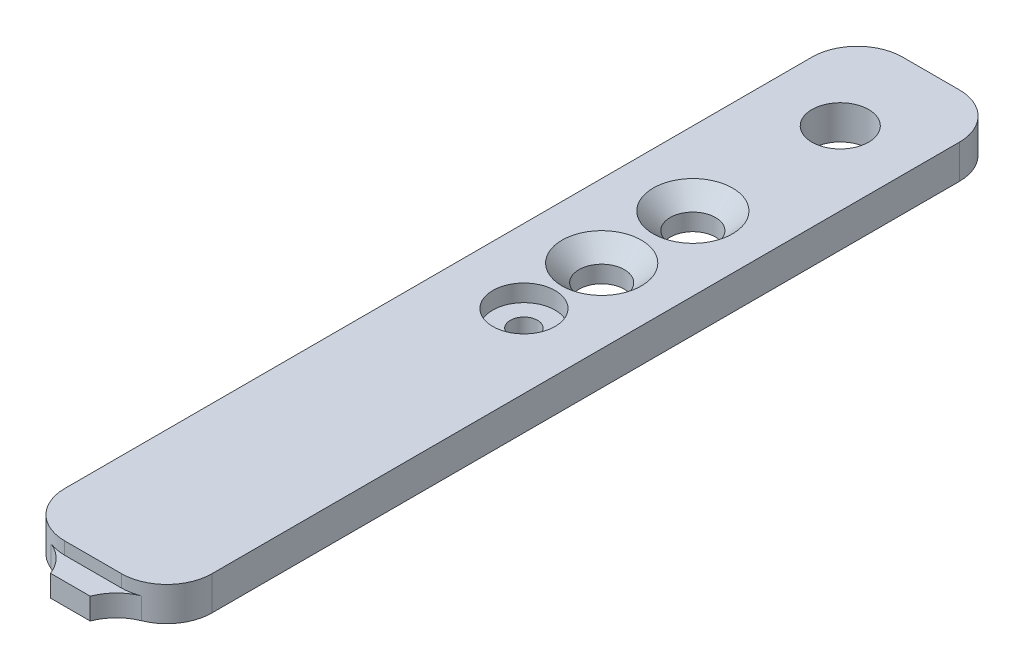
ISO-10303-21;
HEADER;
FILE_DESCRIPTION(('STEP AP214'),'2;1');
FILE_NAME('part.step','',(''),(''),'','','');
FILE_SCHEMA(('AUTOMOTIVE_DESIGN { 1 0 10303 214 1 1 1 1 }'));
ENDSEC;
DATA;
#1=APPLICATION_CONTEXT('core data for automotive mechanical design processes');
#2=APPLICATION_PROTOCOL_DEFINITION('international standard','automotive_design',2000,#1);
#3=PRODUCT_CONTEXT('',#1,'mechanical');
#4=PRODUCT('Part','Part','',(#3));
#5=PRODUCT_RELATED_PRODUCT_CATEGORY('part','',(#4));
#6=PRODUCT_DEFINITION_FORMATION('','',#4);
#7=PRODUCT_DEFINITION_CONTEXT('part definition',#1,'design');
#8=PRODUCT_DEFINITION('design','',#6,#7);
#9=PRODUCT_DEFINITION_SHAPE('','',#8);
#10=(LENGTH_UNIT() NAMED_UNIT(*) SI_UNIT(.MILLI.,.METRE.));
#11=(NAMED_UNIT(*) PLANE_ANGLE_UNIT() SI_UNIT($,.RADIAN.));
#12=(NAMED_UNIT(*) SI_UNIT($,.STERADIAN.) SOLID_ANGLE_UNIT());
#13=UNCERTAINTY_MEASURE_WITH_UNIT(LENGTH_MEASURE(1.E-05),#10,'distance_accuracy_value','');
#14=(GEOMETRIC_REPRESENTATION_CONTEXT(3) GLOBAL_UNCERTAINTY_ASSIGNED_CONTEXT((#13)) GLOBAL_UNIT_ASSIGNED_CONTEXT((#10,
#11,#12)) REPRESENTATION_CONTEXT('',''));
#15=CARTESIAN_POINT('',(0.,0.,0.));
#16=DIRECTION('',(0.,0.,1.));
#17=DIRECTION('',(1.,0.,0.));
#18=AXIS2_PLACEMENT_3D('',#15,#16,#17);
#19=CARTESIAN_POINT('',(9.,0.,-4.));
#20=DIRECTION('',(0.,1.,0.));
#21=DIRECTION('',(0.,0.,1.));
#22=AXIS2_PLACEMENT_3D('',#19,#20,#21);
#23=PLANE('',#22);
#24=CARTESIAN_POINT('',(6.49999999999999,0.,-52.9));
#25=DIRECTION('',(0.,-1.,0.));
#26=DIRECTION('',(0.,0.,-1.));
#27=AXIS2_PLACEMENT_3D('',#24,#25,#26);
#28=CIRCLE('',#27,2.);
#29=CARTESIAN_POINT('',(6.49999999999999,0.,-54.9));
#30=VERTEX_POINT('',#29);
#31=EDGE_CURVE('E221',#30,#30,#28,.T.);
#32=ORIENTED_EDGE('',*,*,#31,.F.);
#33=EDGE_LOOP('',(#32));
#34=FACE_BOUND('',#33,.T.);
#35=CARTESIAN_POINT('',(6.45848354430959,0.,-44.9001077267311));
#36=DIRECTION('',(0.,-1.,0.));
#37=DIRECTION('',(0.,0.,-1.));
#38=AXIS2_PLACEMENT_3D('',#35,#36,#37);
#39=CIRCLE('',#38,2.);
#40=CARTESIAN_POINT('',(6.45848354430959,0.,-46.9001077267311));
#41=VERTEX_POINT('',#40);
#42=EDGE_CURVE('E169',#41,#41,#39,.T.);
#43=ORIENTED_EDGE('',*,*,#42,.F.);
#44=EDGE_LOOP('',(#43));
#45=FACE_BOUND('',#44,.T.);
#46=CARTESIAN_POINT('',(6.5,0.,-38.));
#47=DIRECTION('',(0.,1.,0.));
#48=DIRECTION('',(0.,0.,1.));
#49=AXIS2_PLACEMENT_3D('',#46,#47,#48);
#50=CIRCLE('',#49,1.2);
#51=CARTESIAN_POINT('',(6.5,0.,-36.8));
#52=VERTEX_POINT('',#51);
#53=EDGE_CURVE('E165',#52,#52,#50,.T.);
#54=ORIENTED_EDGE('',*,*,#53,.T.);
#55=EDGE_LOOP('',(#54));
#56=FACE_BOUND('',#55,.T.);
#57=CARTESIAN_POINT('',(6.5,0.,-65.9));
#58=DIRECTION('',(0.,1.,0.));
#59=DIRECTION('',(0.,0.,1.));
#60=AXIS2_PLACEMENT_3D('',#57,#58,#59);
#61=CIRCLE('',#60,2.5);
#62=CARTESIAN_POINT('',(6.5,0.,-63.4));
#63=VERTEX_POINT('',#62);
#64=EDGE_CURVE('E157',#63,#63,#61,.T.);
#65=ORIENTED_EDGE('',*,*,#64,.T.);
#66=EDGE_LOOP('',(#65));
#67=FACE_BOUND('',#66,.T.);
#68=DIRECTION('',(-1.,0.,0.));
#69=VECTOR('',#68,1.);
#70=CARTESIAN_POINT('',(4.75,0.,2.));
#71=LINE('',#70,#69);
#72=CARTESIAN_POINT('',(8.25,0.,2.));
#73=VERTEX_POINT('',#72);
#74=CARTESIAN_POINT('',(4.75,0.,2.));
#75=VERTEX_POINT('',#74);
#76=EDGE_CURVE('E132',#73,#75,#71,.T.);
#77=ORIENTED_EDGE('',*,*,#76,.T.);
#78=CARTESIAN_POINT('',(1.01073718281684,0.,3.4205328521479));
#79=DIRECTION('',(0.,1.,0.));
#80=DIRECTION('',(0.,0.,1.));
#81=AXIS2_PLACEMENT_3D('',#78,#79,#80);
#82=CIRCLE('',#81,4.);
#83=CARTESIAN_POINT('',(2.50536859140842,0.,-0.289733573926052));
#84=VERTEX_POINT('',#83);
#85=EDGE_CURVE('E43',#75,#84,#82,.T.);
#86=ORIENTED_EDGE('',*,*,#85,.T.);
#87=CARTESIAN_POINT('',(4.,0.,-4.));
#88=DIRECTION('',(0.,1.,0.));
#89=DIRECTION('',(0.,0.,-1.));
#90=AXIS2_PLACEMENT_3D('',#87,#88,#89);
#91=CIRCLE('',#90,4.);
#92=CARTESIAN_POINT('',(0.,0.,-4.00000000000003));
#93=VERTEX_POINT('',#92);
#94=EDGE_CURVE('E205',#93,#84,#91,.T.);
#95=ORIENTED_EDGE('',*,*,#94,.F.);
#96=DIRECTION('',(0.,0.,1.));
#97=VECTOR('',#96,1.);
#98=CARTESIAN_POINT('',(0.,0.,-4.00000000000003));
#99=LINE('',#98,#97);
#100=CARTESIAN_POINT('',(0.,0.,-69.9));
#101=VERTEX_POINT('',#100);
#102=EDGE_CURVE('E209',#101,#93,#99,.T.);
#103=ORIENTED_EDGE('',*,*,#102,.F.);
#104=CARTESIAN_POINT('',(4.,0.,-69.9));
#105=DIRECTION('',(0.,1.,0.));
#106=DIRECTION('',(0.,0.,-1.));
#107=AXIS2_PLACEMENT_3D('',#104,#105,#106);
#108=CIRCLE('',#107,4.);
#109=CARTESIAN_POINT('',(4.,0.,-73.9));
#110=VERTEX_POINT('',#109);
#111=EDGE_CURVE('E211',#110,#101,#108,.T.);
#112=ORIENTED_EDGE('',*,*,#111,.F.);
#113=DIRECTION('',(-1.,0.,0.));
#114=VECTOR('',#113,1.);
#115=CARTESIAN_POINT('',(4.,0.,-73.9));
#116=LINE('',#115,#114);
#117=CARTESIAN_POINT('',(8.99999999999999,0.,-73.9));
#118=VERTEX_POINT('',#117);
#119=EDGE_CURVE('E213',#118,#110,#116,.T.);
#120=ORIENTED_EDGE('',*,*,#119,.F.);
#121=CARTESIAN_POINT('',(8.99999999999999,0.,-69.9));
#122=DIRECTION('',(0.,1.,0.));
#123=DIRECTION('',(0.,0.,1.));
#124=AXIS2_PLACEMENT_3D('',#121,#122,#123);
#125=CIRCLE('',#124,4.);
#126=CARTESIAN_POINT('',(13.,0.,-69.9));
#127=VERTEX_POINT('',#126);
#128=EDGE_CURVE('E215',#127,#118,#125,.T.);
#129=ORIENTED_EDGE('',*,*,#128,.F.);
#130=DIRECTION('',(0.,0.,-1.));
#131=VECTOR('',#130,1.);
#132=CARTESIAN_POINT('',(13.,0.,-4.));
#133=LINE('',#132,#131);
#134=CARTESIAN_POINT('',(13.,0.,-4.));
#135=VERTEX_POINT('',#134);
#136=EDGE_CURVE('E217',#135,#127,#133,.T.);
#137=ORIENTED_EDGE('',*,*,#136,.F.);
#138=CARTESIAN_POINT('',(9.,0.,-4.));
#139=DIRECTION('',(0.,1.,0.));
#140=DIRECTION('',(0.,0.,1.));
#141=AXIS2_PLACEMENT_3D('',#138,#139,#140);
#142=CIRCLE('',#141,4.);
#143=CARTESIAN_POINT('',(10.4946314085916,0.,-0.289733573926052));
#144=VERTEX_POINT('',#143);
#145=EDGE_CURVE('E219',#144,#135,#142,.T.);
#146=ORIENTED_EDGE('',*,*,#145,.F.);
#147=CARTESIAN_POINT('',(11.9892628171832,0.,3.4205328521479));
#148=DIRECTION('',(0.,1.,0.));
#149=DIRECTION('',(0.,0.,1.));
#150=AXIS2_PLACEMENT_3D('',#147,#148,#149);
#151=CIRCLE('',#150,4.);
#152=EDGE_CURVE('E146',#144,#73,#151,.T.);
#153=ORIENTED_EDGE('',*,*,#152,.T.);
#154=EDGE_LOOP('',(#77,#86,#95,#103,#112,#120,#129,#137,#146,#153));
#155=FACE_BOUND('',#154,.T.);
#156=ADVANCED_FACE('F35',(#34,#45,#56,#67,#155),#23,.F.);
#157=CARTESIAN_POINT('',(6.5,-8.8,-38.));
#158=DIRECTION('',(0.,1.,0.));
#159=DIRECTION('',(0.,0.,1.));
#160=AXIS2_PLACEMENT_3D('',#157,#158,#159);
#161=CYLINDRICAL_SURFACE('',#160,1.2);
#162=ORIENTED_EDGE('',*,*,#53,.F.);
#163=EDGE_LOOP('',(#162));
#164=FACE_BOUND('',#163,.T.);
#165=CARTESIAN_POINT('',(6.5,1.5,-38.));
#166=DIRECTION('',(0.,1.,0.));
#167=DIRECTION('',(0.,0.,1.));
#168=AXIS2_PLACEMENT_3D('',#165,#166,#167);
#169=CIRCLE('',#168,1.2);
#170=CARTESIAN_POINT('',(6.5,1.5,-36.8));
#171=VERTEX_POINT('',#170);
#172=EDGE_CURVE('E162',#171,#171,#169,.F.);
#173=ORIENTED_EDGE('',*,*,#172,.F.);
#174=EDGE_LOOP('',(#173));
#175=FACE_BOUND('',#174,.T.);
#176=ADVANCED_FACE('F300',(#164,#175),#161,.F.);
#177=CARTESIAN_POINT('',(4.00000000000003,3.,0.));
#178=DIRECTION('',(0.,0.,-1.));
#179=DIRECTION('',(-1.,0.,0.));
#180=AXIS2_PLACEMENT_3D('',#177,#178,#179);
#181=PLANE('',#180);
#182=DIRECTION('',(1.,0.,0.));
#183=VECTOR('',#182,1.);
#184=CARTESIAN_POINT('',(4.75,1.9,0.));
#185=LINE('',#184,#183);
#186=CARTESIAN_POINT('',(4.00000000000003,1.9,0.));
#187=VERTEX_POINT('',#186);
#188=CARTESIAN_POINT('',(9.,1.9,0.));
#189=VERTEX_POINT('',#188);
#190=EDGE_CURVE('E50',#187,#189,#185,.T.);
#191=ORIENTED_EDGE('',*,*,#190,.T.);
#192=DIRECTION('',(0.,-1.,0.));
#193=VECTOR('',#192,1.);
#194=CARTESIAN_POINT('',(9.,3.,0.));
#195=LINE('',#194,#193);
#196=CARTESIAN_POINT('',(9.,3.,0.));
#197=VERTEX_POINT('',#196);
#198=EDGE_CURVE('E201',#197,#189,#195,.T.);
#199=ORIENTED_EDGE('',*,*,#198,.F.);
#200=DIRECTION('',(1.,0.,0.));
#201=VECTOR('',#200,1.);
#202=CARTESIAN_POINT('',(4.00000000000003,3.,0.));
#203=LINE('',#202,#201);
#204=CARTESIAN_POINT('',(4.00000000000003,3.,0.));
#205=VERTEX_POINT('',#204);
#206=EDGE_CURVE('E204',#205,#197,#203,.T.);
#207=ORIENTED_EDGE('',*,*,#206,.F.);
#208=DIRECTION('',(0.,-1.,0.));
#209=VECTOR('',#208,1.);
#210=CARTESIAN_POINT('',(4.00000000000003,3.,0.));
#211=LINE('',#210,#209);
#212=EDGE_CURVE('E199',#205,#187,#211,.T.);
#213=ORIENTED_EDGE('',*,*,#212,.T.);
#214=EDGE_LOOP('',(#191,#199,#207,#213));
#215=FACE_BOUND('',#214,.T.);
#216=ADVANCED_FACE('F263',(#215),#181,.F.);
#217=CARTESIAN_POINT('',(9.,3.,-4.));
#218=DIRECTION('',(0.,-1.,0.));
#219=DIRECTION('',(0.,0.,-1.));
#220=AXIS2_PLACEMENT_3D('',#217,#218,#219);
#221=CYLINDRICAL_SURFACE('',#220,4.);
#222=CARTESIAN_POINT('',(9.,1.9,-4.));
#223=DIRECTION('',(0.,1.,0.));
#224=DIRECTION('',(0.,0.,1.));
#225=AXIS2_PLACEMENT_3D('',#222,#223,#224);
#226=CIRCLE('',#225,4.);
#227=CARTESIAN_POINT('',(10.4946314085916,1.9,-0.289733573926052));
#228=VERTEX_POINT('',#227);
#229=EDGE_CURVE('E154',#189,#228,#226,.T.);
#230=ORIENTED_EDGE('',*,*,#229,.T.);
#231=DIRECTION('',(0.,-1.,0.));
#232=VECTOR('',#231,1.);
#233=CARTESIAN_POINT('',(10.4946314085916,3.,-0.289733573926051));
#234=LINE('',#233,#232);
#235=EDGE_CURVE('E145',#228,#144,#234,.T.);
#236=ORIENTED_EDGE('',*,*,#235,.T.);
#237=ORIENTED_EDGE('',*,*,#145,.T.);
#238=DIRECTION('',(0.,-1.,0.));
#239=VECTOR('',#238,1.);
#240=CARTESIAN_POINT('',(13.,3.,-4.));
#241=LINE('',#240,#239);
#242=CARTESIAN_POINT('',(13.,3.,-4.));
#243=VERTEX_POINT('',#242);
#244=EDGE_CURVE('E181',#243,#135,#241,.T.);
#245=ORIENTED_EDGE('',*,*,#244,.F.);
#246=CARTESIAN_POINT('',(9.,3.,-4.));
#247=DIRECTION('',(0.,1.,0.));
#248=DIRECTION('',(0.,0.,1.));
#249=AXIS2_PLACEMENT_3D('',#246,#247,#248);
#250=CIRCLE('',#249,4.);
#251=EDGE_CURVE('E208',#197,#243,#250,.T.);
#252=ORIENTED_EDGE('',*,*,#251,.F.);
#253=ORIENTED_EDGE('',*,*,#198,.T.);
#254=EDGE_LOOP('',(#230,#236,#237,#245,#252,#253));
#255=FACE_BOUND('',#254,.T.);
#256=ADVANCED_FACE('F254',(#255),#221,.T.);
#257=CARTESIAN_POINT('',(13.,3.,-4.));
#258=DIRECTION('',(-1.,0.,0.));
#259=DIRECTION('',(0.,0.,1.));
#260=AXIS2_PLACEMENT_3D('',#257,#258,#259);
#261=PLANE('',#260);
#262=ORIENTED_EDGE('',*,*,#136,.T.);
#263=DIRECTION('',(0.,-1.,0.));
#264=VECTOR('',#263,1.);
#265=CARTESIAN_POINT('',(13.,3.,-69.9));
#266=LINE('',#265,#264);
#267=CARTESIAN_POINT('',(13.,3.,-69.9));
#268=VERTEX_POINT('',#267);
#269=EDGE_CURVE('E184',#268,#127,#266,.T.);
#270=ORIENTED_EDGE('',*,*,#269,.F.);
#271=DIRECTION('',(0.,0.,-1.));
#272=VECTOR('',#271,1.);
#273=CARTESIAN_POINT('',(13.,3.,-4.));
#274=LINE('',#273,#272);
#275=EDGE_CURVE('E233',#243,#268,#274,.T.);
#276=ORIENTED_EDGE('',*,*,#275,.F.);
#277=ORIENTED_EDGE('',*,*,#244,.T.);
#278=EDGE_LOOP('',(#262,#270,#276,#277));
#279=FACE_BOUND('',#278,.T.);
#280=ADVANCED_FACE('F288',(#279),#261,.F.);
#281=CARTESIAN_POINT('',(8.99999999999999,3.,-69.9));
#282=DIRECTION('',(0.,-1.,0.));
#283=DIRECTION('',(0.,0.,-1.));
#284=AXIS2_PLACEMENT_3D('',#281,#282,#283);
#285=CYLINDRICAL_SURFACE('',#284,4.);
#286=ORIENTED_EDGE('',*,*,#128,.T.);
#287=DIRECTION('',(0.,-1.,0.));
#288=VECTOR('',#287,1.);
#289=CARTESIAN_POINT('',(8.99999999999999,3.,-73.9));
#290=LINE('',#289,#288);
#291=CARTESIAN_POINT('',(8.99999999999999,3.,-73.9));
#292=VERTEX_POINT('',#291);
#293=EDGE_CURVE('E187',#292,#118,#290,.T.);
#294=ORIENTED_EDGE('',*,*,#293,.F.);
#295=CARTESIAN_POINT('',(8.99999999999999,3.,-69.9));
#296=DIRECTION('',(0.,1.,0.));
#297=DIRECTION('',(0.,0.,1.));
#298=AXIS2_PLACEMENT_3D('',#295,#296,#297);
#299=CIRCLE('',#298,4.);
#300=EDGE_CURVE('E231',#268,#292,#299,.T.);
#301=ORIENTED_EDGE('',*,*,#300,.F.);
#302=ORIENTED_EDGE('',*,*,#269,.T.);
#303=EDGE_LOOP('',(#286,#294,#301,#302));
#304=FACE_BOUND('',#303,.T.);
#305=ADVANCED_FACE('F284',(#304),#285,.T.);
#306=CARTESIAN_POINT('',(4.,3.,-73.9));
#307=DIRECTION('',(0.,0.,1.));
#308=DIRECTION('',(1.,0.,0.));
#309=AXIS2_PLACEMENT_3D('',#306,#307,#308);
#310=PLANE('',#309);
#311=ORIENTED_EDGE('',*,*,#119,.T.);
#312=DIRECTION('',(0.,-1.,0.));
#313=VECTOR('',#312,1.);
#314=CARTESIAN_POINT('',(4.,3.,-73.9));
#315=LINE('',#314,#313);
#316=CARTESIAN_POINT('',(4.,3.,-73.9));
#317=VERTEX_POINT('',#316);
#318=EDGE_CURVE('E190',#317,#110,#315,.T.);
#319=ORIENTED_EDGE('',*,*,#318,.F.);
#320=DIRECTION('',(-1.,0.,0.));
#321=VECTOR('',#320,1.);
#322=CARTESIAN_POINT('',(4.,3.,-73.9));
#323=LINE('',#322,#321);
#324=EDGE_CURVE('E229',#292,#317,#323,.T.);
#325=ORIENTED_EDGE('',*,*,#324,.F.);
#326=ORIENTED_EDGE('',*,*,#293,.T.);
#327=EDGE_LOOP('',(#311,#319,#325,#326));
#328=FACE_BOUND('',#327,.T.);
#329=ADVANCED_FACE('F280',(#328),#310,.F.);
#330=CARTESIAN_POINT('',(4.,3.,-69.9));
#331=DIRECTION('',(0.,-1.,0.));
#332=DIRECTION('',(0.,0.,-1.));
#333=AXIS2_PLACEMENT_3D('',#330,#331,#332);
#334=CYLINDRICAL_SURFACE('',#333,4.);
#335=ORIENTED_EDGE('',*,*,#111,.T.);
#336=DIRECTION('',(0.,-1.,0.));
#337=VECTOR('',#336,1.);
#338=CARTESIAN_POINT('',(0.,3.,-69.9));
#339=LINE('',#338,#337);
#340=CARTESIAN_POINT('',(0.,3.,-69.9));
#341=VERTEX_POINT('',#340);
#342=EDGE_CURVE('E193',#341,#101,#339,.T.);
#343=ORIENTED_EDGE('',*,*,#342,.F.);
#344=CARTESIAN_POINT('',(4.,3.,-69.9));
#345=DIRECTION('',(0.,1.,0.));
#346=DIRECTION('',(0.,0.,-1.));
#347=AXIS2_PLACEMENT_3D('',#344,#345,#346);
#348=CIRCLE('',#347,4.);
#349=EDGE_CURVE('E227',#317,#341,#348,.T.);
#350=ORIENTED_EDGE('',*,*,#349,.F.);
#351=ORIENTED_EDGE('',*,*,#318,.T.);
#352=EDGE_LOOP('',(#335,#343,#350,#351));
#353=FACE_BOUND('',#352,.T.);
#354=ADVANCED_FACE('F276',(#353),#334,.T.);
#355=CARTESIAN_POINT('',(0.,3.,-4.00000000000003));
#356=DIRECTION('',(1.,0.,0.));
#357=DIRECTION('',(0.,0.,-1.));
#358=AXIS2_PLACEMENT_3D('',#355,#356,#357);
#359=PLANE('',#358);
#360=DIRECTION('',(0.,-1.,0.));
#361=VECTOR('',#360,1.);
#362=CARTESIAN_POINT('',(0.,3.,-4.00000000000003));
#363=LINE('',#362,#361);
#364=CARTESIAN_POINT('',(0.,3.,-4.00000000000003));
#365=VERTEX_POINT('',#364);
#366=EDGE_CURVE('E196',#365,#93,#363,.T.);
#367=ORIENTED_EDGE('',*,*,#366,.F.);
#368=DIRECTION('',(0.,0.,1.));
#369=VECTOR('',#368,1.);
#370=CARTESIAN_POINT('',(0.,3.,-4.00000000000003));
#371=LINE('',#370,#369);
#372=EDGE_CURVE('E225',#341,#365,#371,.T.);
#373=ORIENTED_EDGE('',*,*,#372,.F.);
#374=ORIENTED_EDGE('',*,*,#342,.T.);
#375=ORIENTED_EDGE('',*,*,#102,.T.);
#376=EDGE_LOOP('',(#367,#373,#374,#375));
#377=FACE_BOUND('',#376,.T.);
#378=ADVANCED_FACE('F272',(#377),#359,.F.);
#379=CARTESIAN_POINT('',(4.,3.,-4.));
#380=DIRECTION('',(0.,-1.,0.));
#381=DIRECTION('',(0.,0.,-1.));
#382=AXIS2_PLACEMENT_3D('',#379,#380,#381);
#383=CYLINDRICAL_SURFACE('',#382,4.);
#384=ORIENTED_EDGE('',*,*,#94,.T.);
#385=DIRECTION('',(0.,-1.,0.));
#386=VECTOR('',#385,1.);
#387=CARTESIAN_POINT('',(2.50536859140842,3.,-0.289733573926052));
#388=LINE('',#387,#386);
#389=CARTESIAN_POINT('',(2.50536859140842,1.9,-0.289733573926052));
#390=VERTEX_POINT('',#389);
#391=EDGE_CURVE('E148',#84,#390,#388,.F.);
#392=ORIENTED_EDGE('',*,*,#391,.T.);
#393=CARTESIAN_POINT('',(4.,1.9,-4.));
#394=DIRECTION('',(0.,1.,0.));
#395=DIRECTION('',(0.,0.,1.));
#396=AXIS2_PLACEMENT_3D('',#393,#394,#395);
#397=CIRCLE('',#396,4.);
#398=EDGE_CURVE('E56',#390,#187,#397,.T.);
#399=ORIENTED_EDGE('',*,*,#398,.T.);
#400=ORIENTED_EDGE('',*,*,#212,.F.);
#401=CARTESIAN_POINT('',(4.,3.,-4.));
#402=DIRECTION('',(0.,1.,0.));
#403=DIRECTION('',(0.,0.,-1.));
#404=AXIS2_PLACEMENT_3D('',#401,#402,#403);
#405=CIRCLE('',#404,4.);
#406=EDGE_CURVE('E223',#365,#205,#405,.T.);
#407=ORIENTED_EDGE('',*,*,#406,.F.);
#408=ORIENTED_EDGE('',*,*,#366,.T.);
#409=EDGE_LOOP('',(#384,#392,#399,#400,#407,#408));
#410=FACE_BOUND('',#409,.T.);
#411=ADVANCED_FACE('F259',(#410),#383,.T.);
#412=CARTESIAN_POINT('',(9.,3.,-4.));
#413=DIRECTION('',(0.,1.,0.));
#414=DIRECTION('',(0.,0.,1.));
#415=AXIS2_PLACEMENT_3D('',#412,#413,#414);
#416=PLANE('',#415);
#417=CARTESIAN_POINT('',(6.5,3.,-65.9));
#418=DIRECTION('',(0.,1.,0.));
#419=DIRECTION('',(0.,0.,1.));
#420=AXIS2_PLACEMENT_3D('',#417,#418,#419);
#421=CIRCLE('',#420,2.5);
#422=CARTESIAN_POINT('',(6.5,3.,-63.4));
#423=VERTEX_POINT('',#422);
#424=EDGE_CURVE('E161',#423,#423,#421,.T.);
#425=ORIENTED_EDGE('',*,*,#424,.F.);
#426=EDGE_LOOP('',(#425));
#427=FACE_BOUND('',#426,.T.);
#428=CARTESIAN_POINT('',(6.5,3.,-38.));
#429=DIRECTION('',(0.,1.,0.));
#430=DIRECTION('',(0.,0.,1.));
#431=AXIS2_PLACEMENT_3D('',#428,#429,#430);
#432=CIRCLE('',#431,2.75);
#433=CARTESIAN_POINT('',(6.5,3.,-35.25));
#434=VERTEX_POINT('',#433);
#435=EDGE_CURVE('E160',#434,#434,#432,.T.);
#436=ORIENTED_EDGE('',*,*,#435,.F.);
#437=EDGE_LOOP('',(#436));
#438=FACE_BOUND('',#437,.T.);
#439=CARTESIAN_POINT('',(6.45848354430959,3.,-44.9001077267311));
#440=DIRECTION('',(0.,1.,0.));
#441=DIRECTION('',(0.,0.,1.));
#442=AXIS2_PLACEMENT_3D('',#439,#440,#441);
#443=CIRCLE('',#442,3.50000000000002);
#444=CARTESIAN_POINT('',(6.45848354430959,3.,-41.4001077267311));
#445=VERTEX_POINT('',#444);
#446=EDGE_CURVE('E172',#445,#445,#443,.F.);
#447=ORIENTED_EDGE('',*,*,#446,.T.);
#448=EDGE_LOOP('',(#447));
#449=FACE_BOUND('',#448,.T.);
#450=CARTESIAN_POINT('',(6.49999999999999,3.,-52.9));
#451=DIRECTION('',(0.,1.,0.));
#452=DIRECTION('',(0.,0.,1.));
#453=AXIS2_PLACEMENT_3D('',#450,#451,#452);
#454=CIRCLE('',#453,3.50000000000002);
#455=CARTESIAN_POINT('',(6.49999999999999,3.,-49.4));
#456=VERTEX_POINT('',#455);
#457=EDGE_CURVE('E175',#456,#456,#454,.F.);
#458=ORIENTED_EDGE('',*,*,#457,.T.);
#459=EDGE_LOOP('',(#458));
#460=FACE_BOUND('',#459,.T.);
#461=ORIENTED_EDGE('',*,*,#251,.T.);
#462=ORIENTED_EDGE('',*,*,#275,.T.);
#463=ORIENTED_EDGE('',*,*,#300,.T.);
#464=ORIENTED_EDGE('',*,*,#324,.T.);
#465=ORIENTED_EDGE('',*,*,#349,.T.);
#466=ORIENTED_EDGE('',*,*,#372,.T.);
#467=ORIENTED_EDGE('',*,*,#406,.T.);
#468=ORIENTED_EDGE('',*,*,#206,.T.);
#469=EDGE_LOOP('',(#461,#462,#463,#464,#465,#466,#467,#468));
#470=FACE_BOUND('',#469,.T.);
#471=ADVANCED_FACE('F265',(#427,#438,#449,#460,#470),#416,.T.);
#472=CARTESIAN_POINT('',(6.49999999999999,10.,-52.9));
#473=DIRECTION('',(0.,-1.,0.));
#474=DIRECTION('',(0.,0.,-1.));
#475=AXIS2_PLACEMENT_3D('',#472,#473,#474);
#476=CYLINDRICAL_SURFACE('',#475,2.);
#477=CARTESIAN_POINT('',(6.49999999999999,1.49999999999998,-52.9));
#478=DIRECTION('',(0.,1.,0.));
#479=DIRECTION('',(0.,0.,1.));
#480=AXIS2_PLACEMENT_3D('',#477,#478,#479);
#481=CIRCLE('',#480,2.);
#482=CARTESIAN_POINT('',(6.49999999999999,1.49999999999998,-50.9));
#483=VERTEX_POINT('',#482);
#484=EDGE_CURVE('E156',#483,#483,#481,.T.);
#485=ORIENTED_EDGE('',*,*,#484,.T.);
#486=EDGE_LOOP('',(#485));
#487=FACE_BOUND('',#486,.T.);
#488=ORIENTED_EDGE('',*,*,#31,.T.);
#489=EDGE_LOOP('',(#488));
#490=FACE_BOUND('',#489,.T.);
#491=ADVANCED_FACE('F346',(#487,#490),#476,.F.);
#492=CARTESIAN_POINT('',(6.45848354430959,10.,-44.9001077267311));
#493=DIRECTION('',(0.,-1.,0.));
#494=DIRECTION('',(0.,0.,-1.));
#495=AXIS2_PLACEMENT_3D('',#492,#493,#494);
#496=CYLINDRICAL_SURFACE('',#495,2.);
#497=CARTESIAN_POINT('',(6.45848354430959,1.49999999999998,-44.9001077267311));
#498=DIRECTION('',(0.,1.,0.));
#499=DIRECTION('',(0.,0.,1.));
#500=AXIS2_PLACEMENT_3D('',#497,#498,#499);
#501=CIRCLE('',#500,2.);
#502=CARTESIAN_POINT('',(6.45848354430959,1.49999999999998,-42.9001077267311));
#503=VERTEX_POINT('',#502);
#504=EDGE_CURVE('E178',#503,#503,#501,.T.);
#505=ORIENTED_EDGE('',*,*,#504,.T.);
#506=EDGE_LOOP('',(#505));
#507=FACE_BOUND('',#506,.T.);
#508=ORIENTED_EDGE('',*,*,#42,.T.);
#509=EDGE_LOOP('',(#508));
#510=FACE_BOUND('',#509,.T.);
#511=ADVANCED_FACE('F354',(#507,#510),#496,.F.);
#512=CARTESIAN_POINT('',(6.45848354430959,1.49999999999998,-44.9001077267311));
#513=DIRECTION('',(0.,1.,0.));
#514=DIRECTION('',(0.,0.,1.));
#515=AXIS2_PLACEMENT_3D('',#512,#513,#514);
#516=CONICAL_SURFACE('',#515,2.,0.785398163397451);
#517=ORIENTED_EDGE('',*,*,#446,.F.);
#518=EDGE_LOOP('',(#517));
#519=FACE_BOUND('',#518,.T.);
#520=ORIENTED_EDGE('',*,*,#504,.F.);
#521=EDGE_LOOP('',(#520));
#522=FACE_BOUND('',#521,.T.);
#523=ADVANCED_FACE('F360',(#519,#522),#516,.F.);
#524=CARTESIAN_POINT('',(6.49999999999999,1.49999999999998,-52.9));
#525=DIRECTION('',(0.,1.,0.));
#526=DIRECTION('',(0.,0.,1.));
#527=AXIS2_PLACEMENT_3D('',#524,#525,#526);
#528=CONICAL_SURFACE('',#527,2.,0.785398163397451);
#529=ORIENTED_EDGE('',*,*,#457,.F.);
#530=EDGE_LOOP('',(#529));
#531=FACE_BOUND('',#530,.T.);
#532=ORIENTED_EDGE('',*,*,#484,.F.);
#533=EDGE_LOOP('',(#532));
#534=FACE_BOUND('',#533,.T.);
#535=ADVANCED_FACE('F368',(#531,#534),#528,.F.);
#536=CARTESIAN_POINT('',(6.5,1.5,-38.));
#537=DIRECTION('',(0.,1.,0.));
#538=DIRECTION('',(0.,0.,1.));
#539=AXIS2_PLACEMENT_3D('',#536,#537,#538);
#540=PLANE('',#539);
#541=CARTESIAN_POINT('',(6.5,1.5,-38.));
#542=DIRECTION('',(0.,1.,0.));
#543=DIRECTION('',(0.,0.,1.));
#544=AXIS2_PLACEMENT_3D('',#541,#542,#543);
#545=CIRCLE('',#544,2.75);
#546=CARTESIAN_POINT('',(6.5,1.5,-35.25));
#547=VERTEX_POINT('',#546);
#548=EDGE_CURVE('E166',#547,#547,#545,.T.);
#549=ORIENTED_EDGE('',*,*,#548,.T.);
#550=EDGE_LOOP('',(#549));
#551=FACE_BOUND('',#550,.T.);
#552=ORIENTED_EDGE('',*,*,#172,.T.);
#553=EDGE_LOOP('',(#552));
#554=FACE_BOUND('',#553,.T.);
#555=ADVANCED_FACE('F376',(#551,#554),#540,.T.);
#556=CARTESIAN_POINT('',(6.5,1.5,-38.));
#557=DIRECTION('',(0.,1.,0.));
#558=DIRECTION('',(0.,0.,1.));
#559=AXIS2_PLACEMENT_3D('',#556,#557,#558);
#560=CYLINDRICAL_SURFACE('',#559,2.75);
#561=ORIENTED_EDGE('',*,*,#548,.F.);
#562=EDGE_LOOP('',(#561));
#563=FACE_BOUND('',#562,.T.);
#564=ORIENTED_EDGE('',*,*,#435,.T.);
#565=EDGE_LOOP('',(#564));
#566=FACE_BOUND('',#565,.T.);
#567=ADVANCED_FACE('F385',(#563,#566),#560,.F.);
#568=CARTESIAN_POINT('',(6.5,-7.,-65.9));
#569=DIRECTION('',(0.,1.,0.));
#570=DIRECTION('',(0.,0.,1.));
#571=AXIS2_PLACEMENT_3D('',#568,#569,#570);
#572=CYLINDRICAL_SURFACE('',#571,2.5);
#573=ORIENTED_EDGE('',*,*,#424,.T.);
#574=EDGE_LOOP('',(#573));
#575=FACE_BOUND('',#574,.T.);
#576=ORIENTED_EDGE('',*,*,#64,.F.);
#577=EDGE_LOOP('',(#576));
#578=FACE_BOUND('',#577,.T.);
#579=ADVANCED_FACE('F393',(#575,#578),#572,.F.);
#580=CARTESIAN_POINT('',(4.75,1.9,2.));
#581=DIRECTION('',(0.,0.,1.));
#582=DIRECTION('',(1.,0.,0.));
#583=AXIS2_PLACEMENT_3D('',#580,#581,#582);
#584=PLANE('',#583);
#585=ORIENTED_EDGE('',*,*,#76,.F.);
#586=DIRECTION('',(0.,-1.,0.));
#587=VECTOR('',#586,1.);
#588=CARTESIAN_POINT('',(8.25,1.9,2.));
#589=LINE('',#588,#587);
#590=CARTESIAN_POINT('',(8.25,1.9,2.));
#591=VERTEX_POINT('',#590);
#592=EDGE_CURVE('E125',#591,#73,#589,.T.);
#593=ORIENTED_EDGE('',*,*,#592,.F.);
#594=DIRECTION('',(-1.,0.,0.));
#595=VECTOR('',#594,1.);
#596=CARTESIAN_POINT('',(4.75,1.9,2.));
#597=LINE('',#596,#595);
#598=CARTESIAN_POINT('',(4.75,1.9,2.));
#599=VERTEX_POINT('',#598);
#600=EDGE_CURVE('E129',#591,#599,#597,.T.);
#601=ORIENTED_EDGE('',*,*,#600,.T.);
#602=DIRECTION('',(0.,-1.,0.));
#603=VECTOR('',#602,1.);
#604=CARTESIAN_POINT('',(4.75,1.9,2.));
#605=LINE('',#604,#603);
#606=EDGE_CURVE('E135',#599,#75,#605,.T.);
#607=ORIENTED_EDGE('',*,*,#606,.T.);
#608=EDGE_LOOP('',(#585,#593,#601,#607));
#609=FACE_BOUND('',#608,.T.);
#610=ADVANCED_FACE('F127',(#609),#584,.T.);
#611=CARTESIAN_POINT('',(0.,1.9,0.));
#612=DIRECTION('',(0.,1.,0.));
#613=DIRECTION('',(0.,0.,1.));
#614=AXIS2_PLACEMENT_3D('',#611,#612,#613);
#615=PLANE('',#614);
#616=ORIENTED_EDGE('',*,*,#190,.F.);
#617=ORIENTED_EDGE('',*,*,#398,.F.);
#618=CARTESIAN_POINT('',(1.01073718281684,1.9,3.4205328521479));
#619=DIRECTION('',(0.,1.,0.));
#620=DIRECTION('',(0.,0.,1.));
#621=AXIS2_PLACEMENT_3D('',#618,#619,#620);
#622=CIRCLE('',#621,4.);
#623=EDGE_CURVE('E11',#390,#599,#622,.F.);
#624=ORIENTED_EDGE('',*,*,#623,.T.);
#625=ORIENTED_EDGE('',*,*,#600,.F.);
#626=CARTESIAN_POINT('',(11.9892628171832,1.9,3.4205328521479));
#627=DIRECTION('',(0.,1.,0.));
#628=DIRECTION('',(0.,0.,1.));
#629=AXIS2_PLACEMENT_3D('',#626,#627,#628);
#630=CIRCLE('',#629,4.);
#631=EDGE_CURVE('E138',#591,#228,#630,.F.);
#632=ORIENTED_EDGE('',*,*,#631,.T.);
#633=ORIENTED_EDGE('',*,*,#229,.F.);
#634=EDGE_LOOP('',(#616,#617,#624,#625,#632,#633));
#635=FACE_BOUND('',#634,.T.);
#636=ADVANCED_FACE('F137',(#635),#615,.T.);
#637=CARTESIAN_POINT('',(11.9892628171832,1.9,3.4205328521479));
#638=DIRECTION('',(0.,1.,0.));
#639=DIRECTION('',(0.,0.,1.));
#640=AXIS2_PLACEMENT_3D('',#637,#638,#639);
#641=CYLINDRICAL_SURFACE('',#640,4.);
#642=ORIENTED_EDGE('',*,*,#631,.F.);
#643=ORIENTED_EDGE('',*,*,#592,.T.);
#644=ORIENTED_EDGE('',*,*,#152,.F.);
#645=ORIENTED_EDGE('',*,*,#235,.F.);
#646=EDGE_LOOP('',(#642,#643,#644,#645));
#647=FACE_BOUND('',#646,.T.);
#648=ADVANCED_FACE('F143',(#647),#641,.F.);
#649=CARTESIAN_POINT('',(1.01073718281684,3.,3.4205328521479));
#650=DIRECTION('',(0.,1.,0.));
#651=DIRECTION('',(0.,0.,1.));
#652=AXIS2_PLACEMENT_3D('',#649,#650,#651);
#653=CYLINDRICAL_SURFACE('',#652,4.);
#654=ORIENTED_EDGE('',*,*,#623,.F.);
#655=ORIENTED_EDGE('',*,*,#391,.F.);
#656=ORIENTED_EDGE('',*,*,#85,.F.);
#657=ORIENTED_EDGE('',*,*,#606,.F.);
#658=EDGE_LOOP('',(#654,#655,#656,#657));
#659=FACE_BOUND('',#658,.T.);
#660=ADVANCED_FACE('F37',(#659),#653,.F.);
#661=CLOSED_SHELL('',(#156,#176,#216,#256,#280,#305,#329,#354,#378,#411,#471,#491,#511,#523,
#535,#555,#567,#579,#610,#636,#648,#660));
#662=MANIFOLD_SOLID_BREP('B2',#661);
#663=ADVANCED_BREP_SHAPE_REPRESENTATION('',(#18,#662),#14);
#664=SHAPE_DEFINITION_REPRESENTATION(#9,#663);
ENDSEC;
END-ISO-10303-21;
